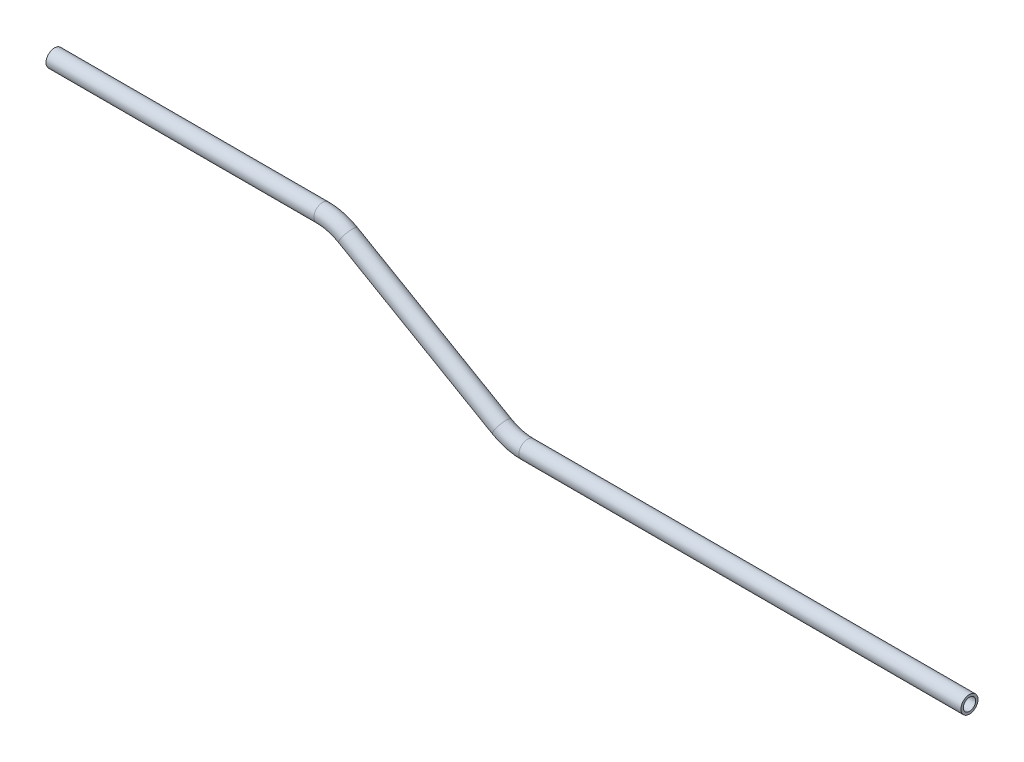
ISO-10303-21;
HEADER;
FILE_DESCRIPTION(('STEP AP214'),'2;1');
FILE_NAME('part.step','',(''),(''),'','','');
FILE_SCHEMA(('AUTOMOTIVE_DESIGN { 1 0 10303 214 1 1 1 1 }'));
ENDSEC;
DATA;
#1=APPLICATION_CONTEXT('core data for automotive mechanical design processes');
#2=APPLICATION_PROTOCOL_DEFINITION('international standard','automotive_design',2000,#1);
#3=PRODUCT_CONTEXT('',#1,'mechanical');
#4=PRODUCT('Part','Part','',(#3));
#5=PRODUCT_RELATED_PRODUCT_CATEGORY('part','',(#4));
#6=PRODUCT_DEFINITION_FORMATION('','',#4);
#7=PRODUCT_DEFINITION_CONTEXT('part definition',#1,'design');
#8=PRODUCT_DEFINITION('design','',#6,#7);
#9=PRODUCT_DEFINITION_SHAPE('','',#8);
#10=(LENGTH_UNIT() NAMED_UNIT(*) SI_UNIT(.MILLI.,.METRE.));
#11=(NAMED_UNIT(*) PLANE_ANGLE_UNIT() SI_UNIT($,.RADIAN.));
#12=(NAMED_UNIT(*) SI_UNIT($,.STERADIAN.) SOLID_ANGLE_UNIT());
#13=UNCERTAINTY_MEASURE_WITH_UNIT(LENGTH_MEASURE(1.E-05),#10,'distance_accuracy_value','');
#14=(GEOMETRIC_REPRESENTATION_CONTEXT(3) GLOBAL_UNCERTAINTY_ASSIGNED_CONTEXT((#13)) GLOBAL_UNIT_ASSIGNED_CONTEXT((#10,
#11,#12)) REPRESENTATION_CONTEXT('',''));
#15=CARTESIAN_POINT('',(0.,0.,0.));
#16=DIRECTION('',(0.,0.,1.));
#17=DIRECTION('',(1.,0.,0.));
#18=AXIS2_PLACEMENT_3D('',#15,#16,#17);
#19=CARTESIAN_POINT('',(-56.1297831876973,3.07427314219325,0.));
#20=DIRECTION('',(1.,0.,0.));
#21=DIRECTION('',(0.,1.,0.));
#22=AXIS2_PLACEMENT_3D('',#19,#20,#21);
#23=CYLINDRICAL_SURFACE('',#22,3.175);
#24=CARTESIAN_POINT('',(43.4658546964898,3.07427314219325,0.));
#25=DIRECTION('',(1.,0.,0.));
#26=DIRECTION('',(0.,1.,0.));
#27=AXIS2_PLACEMENT_3D('',#24,#25,#26);
#28=CIRCLE('',#27,3.175);
#29=CARTESIAN_POINT('',(43.4658546964898,6.24927314219325,0.));
#30=VERTEX_POINT('',#29);
#31=EDGE_CURVE('E59',#30,#30,#28,.T.);
#32=ORIENTED_EDGE('',*,*,#31,.F.);
#33=EDGE_LOOP('',(#32));
#34=FACE_BOUND('',#33,.T.);
#35=CARTESIAN_POINT('',(-56.1297831876973,3.07427314219325,0.));
#36=DIRECTION('',(1.,0.,0.));
#37=DIRECTION('',(0.,1.,0.));
#38=AXIS2_PLACEMENT_3D('',#35,#36,#37);
#39=CIRCLE('',#38,3.175);
#40=CARTESIAN_POINT('',(-56.1297831876973,6.24927314219325,0.));
#41=VERTEX_POINT('',#40);
#42=EDGE_CURVE('E56',#41,#41,#39,.T.);
#43=ORIENTED_EDGE('',*,*,#42,.T.);
#44=EDGE_LOOP('',(#43));
#45=FACE_BOUND('',#44,.T.);
#46=ADVANCED_FACE('F35',(#34,#45),#23,.T.);
#47=CARTESIAN_POINT('',(43.4658546964898,-15.9757268578068,0.));
#48=DIRECTION('',(0.,0.,-1.));
#49=DIRECTION('',(-1.,0.,0.));
#50=AXIS2_PLACEMENT_3D('',#47,#48,#49);
#51=TOROIDAL_SURFACE('',#50,19.05,3.175);
#52=CARTESIAN_POINT('',(52.9908546964898,0.522057084286792,0.));
#53=DIRECTION('',(0.866025403784438,-0.500000000000001,0.));
#54=DIRECTION('',(0.500000000000001,0.866025403784438,0.));
#55=AXIS2_PLACEMENT_3D('',#52,#53,#54);
#56=CIRCLE('',#55,3.175);
#57=CARTESIAN_POINT('',(54.5783546964898,3.27168774130239,0.));
#58=VERTEX_POINT('',#57);
#59=EDGE_CURVE('E62',#58,#58,#56,.T.);
#60=CARTESIAN_POINT('',(43.4658546964898,-15.9757268578068,0.));
#61=DIRECTION('',(0.,0.,-1.));
#62=DIRECTION('',(-1.,0.,0.));
#63=AXIS2_PLACEMENT_3D('',#60,#61,#62);
#64=CIRCLE('',#63,22.225);
#65=EDGE_CURVE('',#30,#58,#64,.T.);
#66=ORIENTED_EDGE('',*,*,#31,.T.);
#67=ORIENTED_EDGE('',*,*,#59,.F.);
#68=ORIENTED_EDGE('',*,*,#65,.T.);
#69=ORIENTED_EDGE('',*,*,#65,.F.);
#70=EDGE_LOOP('',(#66,#68,#67,#69));
#71=FACE_BOUND('',#70,.T.);
#72=ADVANCED_FACE('F81',(#71),#51,.T.);
#73=CARTESIAN_POINT('',(52.9908546964898,0.522057084286799,0.));
#74=DIRECTION('',(0.866025403784438,-0.500000000000001,0.));
#75=DIRECTION('',(0.500000000000001,0.866025403784438,0.));
#76=AXIS2_PLACEMENT_3D('',#73,#74,#75);
#77=CYLINDRICAL_SURFACE('',#76,3.175);
#78=CARTESIAN_POINT('',(110.14085469649,-32.4735107999003,0.));
#79=DIRECTION('',(0.866025403784438,-0.500000000000001,0.));
#80=DIRECTION('',(0.500000000000001,0.866025403784438,0.));
#81=AXIS2_PLACEMENT_3D('',#78,#79,#80);
#82=CIRCLE('',#81,3.175);
#83=CARTESIAN_POINT('',(108.55335469649,-35.2231414569159,0.));
#84=VERTEX_POINT('',#83);
#85=EDGE_CURVE('E64',#84,#84,#82,.T.);
#86=ORIENTED_EDGE('',*,*,#85,.F.);
#87=EDGE_LOOP('',(#86));
#88=FACE_BOUND('',#87,.T.);
#89=ORIENTED_EDGE('',*,*,#59,.T.);
#90=EDGE_LOOP('',(#89));
#91=FACE_BOUND('',#90,.T.);
#92=ADVANCED_FACE('F74',(#88,#91),#77,.T.);
#93=CARTESIAN_POINT('',(119.66585469649,-15.9757268578067,0.));
#94=DIRECTION('',(0.,0.,1.));
#95=DIRECTION('',(1.,0.,0.));
#96=AXIS2_PLACEMENT_3D('',#93,#94,#95);
#97=TOROIDAL_SURFACE('',#96,19.05,3.175);
#98=CARTESIAN_POINT('',(119.66585469649,-35.0257268578067,0.));
#99=DIRECTION('',(1.,0.,0.));
#100=DIRECTION('',(0.,1.,0.));
#101=AXIS2_PLACEMENT_3D('',#98,#99,#100);
#102=CIRCLE('',#101,3.175);
#103=CARTESIAN_POINT('',(119.66585469649,-38.2007268578067,0.));
#104=VERTEX_POINT('',#103);
#105=EDGE_CURVE('E39',#104,#104,#102,.T.);
#106=CARTESIAN_POINT('',(119.66585469649,-15.9757268578067,0.));
#107=DIRECTION('',(0.,0.,1.));
#108=DIRECTION('',(1.,0.,0.));
#109=AXIS2_PLACEMENT_3D('',#106,#107,#108);
#110=CIRCLE('',#109,22.225);
#111=EDGE_CURVE('',#84,#104,#110,.T.);
#112=ORIENTED_EDGE('',*,*,#85,.T.);
#113=ORIENTED_EDGE('',*,*,#105,.F.);
#114=ORIENTED_EDGE('',*,*,#111,.T.);
#115=ORIENTED_EDGE('',*,*,#111,.F.);
#116=EDGE_LOOP('',(#112,#114,#113,#115));
#117=FACE_BOUND('',#116,.T.);
#118=ADVANCED_FACE('F72',(#117),#97,.T.);
#119=CARTESIAN_POINT('',(119.66585469649,-35.0257268578067,0.));
#120=DIRECTION('',(1.,0.,0.));
#121=DIRECTION('',(0.,0.,-1.));
#122=AXIS2_PLACEMENT_3D('',#119,#120,#121);
#123=CYLINDRICAL_SURFACE('',#122,3.175);
#124=CARTESIAN_POINT('',(283.979422580677,-35.0257268578067,0.));
#125=DIRECTION('',(1.,0.,0.));
#126=DIRECTION('',(0.,1.,0.));
#127=AXIS2_PLACEMENT_3D('',#124,#125,#126);
#128=CIRCLE('',#127,3.175);
#129=CARTESIAN_POINT('',(283.979422580677,-31.8507268578067,0.));
#130=VERTEX_POINT('',#129);
#131=EDGE_CURVE('E52',#130,#130,#128,.T.);
#132=ORIENTED_EDGE('',*,*,#131,.F.);
#133=EDGE_LOOP('',(#132));
#134=FACE_BOUND('',#133,.T.);
#135=ORIENTED_EDGE('',*,*,#105,.T.);
#136=EDGE_LOOP('',(#135));
#137=FACE_BOUND('',#136,.T.);
#138=ADVANCED_FACE('F37',(#134,#137),#123,.T.);
#139=CARTESIAN_POINT('',(-56.1297831876973,3.07427314219325,0.));
#140=DIRECTION('',(1.,0.,0.));
#141=DIRECTION('',(0.,1.,0.));
#142=AXIS2_PLACEMENT_3D('',#139,#140,#141);
#143=PLANE('',#142);
#144=CARTESIAN_POINT('',(-56.1297831876973,3.07427314219325,0.));
#145=DIRECTION('',(1.,0.,0.));
#146=DIRECTION('',(0.,1.,0.));
#147=AXIS2_PLACEMENT_3D('',#144,#145,#146);
#148=CIRCLE('',#147,2.286);
#149=CARTESIAN_POINT('',(-56.1297831876973,5.36027314219325,0.));
#150=VERTEX_POINT('',#149);
#151=EDGE_CURVE('E55',#150,#150,#148,.F.);
#152=ORIENTED_EDGE('',*,*,#151,.F.);
#153=EDGE_LOOP('',(#152));
#154=FACE_BOUND('',#153,.T.);
#155=ORIENTED_EDGE('',*,*,#42,.F.);
#156=EDGE_LOOP('',(#155));
#157=FACE_BOUND('',#156,.T.);
#158=ADVANCED_FACE('F79',(#154,#157),#143,.F.);
#159=CARTESIAN_POINT('',(283.979422580677,-35.0257268578067,0.));
#160=DIRECTION('',(1.,0.,0.));
#161=DIRECTION('',(0.,1.,0.));
#162=AXIS2_PLACEMENT_3D('',#159,#160,#161);
#163=PLANE('',#162);
#164=CARTESIAN_POINT('',(283.979422580677,-35.0257268578067,0.));
#165=DIRECTION('',(1.,0.,0.));
#166=DIRECTION('',(0.,1.,0.));
#167=AXIS2_PLACEMENT_3D('',#164,#165,#166);
#168=CIRCLE('',#167,2.286);
#169=CARTESIAN_POINT('',(283.979422580677,-32.7397268578067,0.));
#170=VERTEX_POINT('',#169);
#171=EDGE_CURVE('E10',#170,#170,#168,.F.);
#172=ORIENTED_EDGE('',*,*,#171,.T.);
#173=EDGE_LOOP('',(#172));
#174=FACE_BOUND('',#173,.T.);
#175=ORIENTED_EDGE('',*,*,#131,.T.);
#176=EDGE_LOOP('',(#175));
#177=FACE_BOUND('',#176,.T.);
#178=ADVANCED_FACE('F98',(#174,#177),#163,.T.);
#179=CARTESIAN_POINT('',(-56.1297831876973,3.07427314219325,0.));
#180=DIRECTION('',(1.,0.,0.));
#181=DIRECTION('',(0.,1.,0.));
#182=AXIS2_PLACEMENT_3D('',#179,#180,#181);
#183=CYLINDRICAL_SURFACE('',#182,2.286);
#184=CARTESIAN_POINT('',(43.4658546964898,3.07427314219325,0.));
#185=DIRECTION('',(1.,0.,0.));
#186=DIRECTION('',(0.,1.,0.));
#187=AXIS2_PLACEMENT_3D('',#184,#185,#186);
#188=CIRCLE('',#187,2.286);
#189=CARTESIAN_POINT('',(43.4658546964898,5.36027314219325,0.));
#190=VERTEX_POINT('',#189);
#191=EDGE_CURVE('E194',#190,#190,#188,.F.);
#192=ORIENTED_EDGE('',*,*,#191,.F.);
#193=EDGE_LOOP('',(#192));
#194=FACE_BOUND('',#193,.T.);
#195=ORIENTED_EDGE('',*,*,#151,.T.);
#196=EDGE_LOOP('',(#195));
#197=FACE_BOUND('',#196,.T.);
#198=ADVANCED_FACE('F101',(#194,#197),#183,.F.);
#199=CARTESIAN_POINT('',(43.4658546964898,-15.9757268578068,0.));
#200=DIRECTION('',(0.,0.,-1.));
#201=DIRECTION('',(-1.,0.,0.));
#202=AXIS2_PLACEMENT_3D('',#199,#200,#201);
#203=TOROIDAL_SURFACE('',#202,19.05,2.286);
#204=CARTESIAN_POINT('',(52.9908546964898,0.522057084286792,0.));
#205=DIRECTION('',(0.866025403784438,-0.500000000000001,0.));
#206=DIRECTION('',(0.500000000000001,0.866025403784438,0.));
#207=AXIS2_PLACEMENT_3D('',#204,#205,#206);
#208=CIRCLE('',#207,2.286);
#209=CARTESIAN_POINT('',(54.1338546964898,2.50179115733802,0.));
#210=VERTEX_POINT('',#209);
#211=EDGE_CURVE('E193',#210,#210,#208,.F.);
#212=CARTESIAN_POINT('',(43.4658546964898,-15.9757268578068,0.));
#213=DIRECTION('',(0.,0.,-1.));
#214=DIRECTION('',(-1.,0.,0.));
#215=AXIS2_PLACEMENT_3D('',#212,#213,#214);
#216=CIRCLE('',#215,21.336);
#217=EDGE_CURVE('',#190,#210,#216,.T.);
#218=ORIENTED_EDGE('',*,*,#191,.T.);
#219=ORIENTED_EDGE('',*,*,#211,.F.);
#220=ORIENTED_EDGE('',*,*,#217,.T.);
#221=ORIENTED_EDGE('',*,*,#217,.F.);
#222=EDGE_LOOP('',(#218,#220,#219,#221));
#223=FACE_BOUND('',#222,.T.);
#224=ADVANCED_FACE('F156',(#223),#203,.F.);
#225=CARTESIAN_POINT('',(52.9908546964898,0.522057084286799,0.));
#226=DIRECTION('',(0.866025403784438,-0.500000000000001,0.));
#227=DIRECTION('',(0.500000000000001,0.866025403784438,0.));
#228=AXIS2_PLACEMENT_3D('',#225,#226,#227);
#229=CYLINDRICAL_SURFACE('',#228,2.286);
#230=CARTESIAN_POINT('',(110.14085469649,-32.4735107999003,0.));
#231=DIRECTION('',(0.866025403784438,-0.500000000000001,0.));
#232=DIRECTION('',(0.500000000000001,0.866025403784438,0.));
#233=AXIS2_PLACEMENT_3D('',#230,#231,#232);
#234=CIRCLE('',#233,2.286);
#235=CARTESIAN_POINT('',(108.99785469649,-34.4532448729515,0.));
#236=VERTEX_POINT('',#235);
#237=EDGE_CURVE('E48',#236,#236,#234,.F.);
#238=ORIENTED_EDGE('',*,*,#237,.F.);
#239=EDGE_LOOP('',(#238));
#240=FACE_BOUND('',#239,.T.);
#241=ORIENTED_EDGE('',*,*,#211,.T.);
#242=EDGE_LOOP('',(#241));
#243=FACE_BOUND('',#242,.T.);
#244=ADVANCED_FACE('F92',(#240,#243),#229,.F.);
#245=CARTESIAN_POINT('',(119.66585469649,-15.9757268578067,0.));
#246=DIRECTION('',(0.,0.,1.));
#247=DIRECTION('',(1.,0.,0.));
#248=AXIS2_PLACEMENT_3D('',#245,#246,#247);
#249=TOROIDAL_SURFACE('',#248,19.05,2.286);
#250=CARTESIAN_POINT('',(119.66585469649,-35.0257268578067,0.));
#251=DIRECTION('',(1.,0.,0.));
#252=DIRECTION('',(0.,1.,0.));
#253=AXIS2_PLACEMENT_3D('',#250,#251,#252);
#254=CIRCLE('',#253,2.286);
#255=CARTESIAN_POINT('',(119.66585469649,-37.3117268578067,0.));
#256=VERTEX_POINT('',#255);
#257=EDGE_CURVE('E43',#256,#256,#254,.F.);
#258=CARTESIAN_POINT('',(119.66585469649,-15.9757268578067,0.));
#259=DIRECTION('',(0.,0.,1.));
#260=DIRECTION('',(1.,0.,0.));
#261=AXIS2_PLACEMENT_3D('',#258,#259,#260);
#262=CIRCLE('',#261,21.336);
#263=EDGE_CURVE('',#236,#256,#262,.T.);
#264=ORIENTED_EDGE('',*,*,#237,.T.);
#265=ORIENTED_EDGE('',*,*,#257,.F.);
#266=ORIENTED_EDGE('',*,*,#263,.T.);
#267=ORIENTED_EDGE('',*,*,#263,.F.);
#268=EDGE_LOOP('',(#264,#266,#265,#267));
#269=FACE_BOUND('',#268,.T.);
#270=ADVANCED_FACE('F86',(#269),#249,.F.);
#271=CARTESIAN_POINT('',(119.66585469649,-35.0257268578067,0.));
#272=DIRECTION('',(1.,0.,0.));
#273=DIRECTION('',(0.,0.,-1.));
#274=AXIS2_PLACEMENT_3D('',#271,#272,#273);
#275=CYLINDRICAL_SURFACE('',#274,2.286);
#276=ORIENTED_EDGE('',*,*,#171,.F.);
#277=EDGE_LOOP('',(#276));
#278=FACE_BOUND('',#277,.T.);
#279=ORIENTED_EDGE('',*,*,#257,.T.);
#280=EDGE_LOOP('',(#279));
#281=FACE_BOUND('',#280,.T.);
#282=ADVANCED_FACE('F84',(#278,#281),#275,.F.);
#283=CLOSED_SHELL('',(#46,#72,#92,#118,#138,#158,#178,#198,#224,#244,#270,#282));
#284=MANIFOLD_SOLID_BREP('B2',#283);
#285=ADVANCED_BREP_SHAPE_REPRESENTATION('',(#18,#284),#14);
#286=SHAPE_DEFINITION_REPRESENTATION(#9,#285);
ENDSEC;
END-ISO-10303-21;
